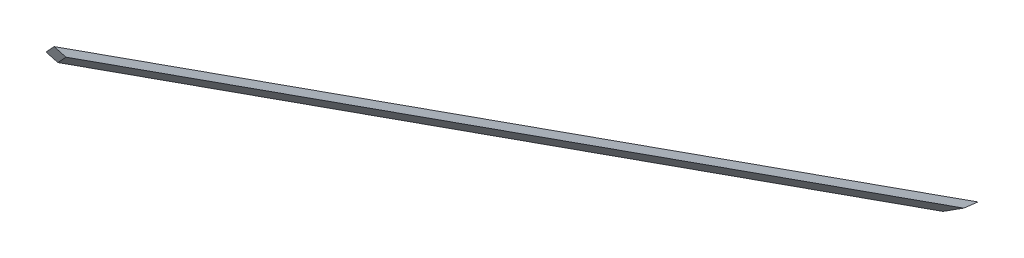
ISO-10303-21;
HEADER;
FILE_DESCRIPTION(('STEP AP214'),'2;1');
FILE_NAME('part.step','',(''),(''),'','','');
FILE_SCHEMA(('AUTOMOTIVE_DESIGN { 1 0 10303 214 1 1 1 1 }'));
ENDSEC;
DATA;
#1=APPLICATION_CONTEXT('core data for automotive mechanical design processes');
#2=APPLICATION_PROTOCOL_DEFINITION('international standard','automotive_design',2000,#1);
#3=PRODUCT_CONTEXT('',#1,'mechanical');
#4=PRODUCT('Part','Part','',(#3));
#5=PRODUCT_RELATED_PRODUCT_CATEGORY('part','',(#4));
#6=PRODUCT_DEFINITION_FORMATION('','',#4);
#7=PRODUCT_DEFINITION_CONTEXT('part definition',#1,'design');
#8=PRODUCT_DEFINITION('design','',#6,#7);
#9=PRODUCT_DEFINITION_SHAPE('','',#8);
#10=(LENGTH_UNIT() NAMED_UNIT(*) SI_UNIT(.MILLI.,.METRE.));
#11=(NAMED_UNIT(*) PLANE_ANGLE_UNIT() SI_UNIT($,.RADIAN.));
#12=(NAMED_UNIT(*) SI_UNIT($,.STERADIAN.) SOLID_ANGLE_UNIT());
#13=UNCERTAINTY_MEASURE_WITH_UNIT(LENGTH_MEASURE(1.E-05),#10,'distance_accuracy_value','');
#14=(GEOMETRIC_REPRESENTATION_CONTEXT(3) GLOBAL_UNCERTAINTY_ASSIGNED_CONTEXT((#13)) GLOBAL_UNIT_ASSIGNED_CONTEXT((#10,
#11,#12)) REPRESENTATION_CONTEXT('',''));
#15=CARTESIAN_POINT('',(0.,0.,0.));
#16=DIRECTION('',(0.,0.,1.));
#17=DIRECTION('',(1.,0.,0.));
#18=AXIS2_PLACEMENT_3D('',#15,#16,#17);
#19=CARTESIAN_POINT('',(0.,0.,0.));
#20=DIRECTION('',(-0.0650366103204272,0.480974248354035,-0.87431917040535));
#21=DIRECTION('',(0.,0.876174137459205,0.481994689646699));
#22=AXIS2_PLACEMENT_3D('',#19,#20,#21);
#23=PLANE('',#22);
#24=DIRECTION('',(0.654469130781617,0.681969712719901,0.326477361828797));
#25=VECTOR('',#24,1.);
#26=CARTESIAN_POINT('',(0.,0.,0.));
#27=LINE('',#26,#25);
#28=CARTESIAN_POINT('',(4844.17184578383,5047.72238545407,2416.48134354034));
#29=VERTEX_POINT('',#28);
#30=CARTESIAN_POINT('',(4911.52852168568,5117.90936716807,2450.08175158974));
#31=VERTEX_POINT('',#30);
#32=EDGE_CURVE('E106',#29,#31,#27,.T.);
#33=ORIENTED_EDGE('',*,*,#32,.F.);
#34=DIRECTION('',(0.577222347305059,-0.696579994970428,-0.426134570738677));
#35=VECTOR('',#34,1.);
#36=CARTESIAN_POINT('',(5854.15188859412,3828.89935057735,1670.86327451201));
#37=LINE('',#36,#35);
#38=CARTESIAN_POINT('',(4872.72774204691,5013.26172022138,2395.39994457346));
#39=VERTEX_POINT('',#38);
#40=EDGE_CURVE('E61',#29,#39,#37,.T.);
#41=ORIENTED_EDGE('',*,*,#40,.T.);
#42=DIRECTION('',(0.654469130781619,0.6819697127199,0.326477361828794));
#43=VECTOR('',#42,1.);
#44=CARTESIAN_POINT('',(36.2097667232203,-26.4851816026538,-17.263319063484));
#45=LINE('',#44,#43);
#46=CARTESIAN_POINT('',(4940.08441794875,5083.44870193537,2429.00035262285));
#47=VERTEX_POINT('',#46);
#48=EDGE_CURVE('E95',#39,#47,#45,.T.);
#49=ORIENTED_EDGE('',*,*,#48,.T.);
#50=DIRECTION('',(0.577222347305059,-0.696579994970428,-0.426134570738677));
#51=VECTOR('',#50,1.);
#52=CARTESIAN_POINT('',(5935.55201724218,3882.13898385792,1694.09609936638));
#53=LINE('',#52,#51);
#54=EDGE_CURVE('E68',#31,#47,#53,.T.);
#55=ORIENTED_EDGE('',*,*,#54,.F.);
#56=EDGE_LOOP('',(#33,#41,#49,#55));
#57=FACE_BOUND('',#56,.T.);
#58=ADVANCED_FACE('F45',(#57),#23,.F.);
#59=CARTESIAN_POINT('',(0.,0.,0.));
#60=DIRECTION('',(-0.537110456627946,0.841606576533205,-0.0566632836762697));
#61=DIRECTION('',(-0.842960923517797,-0.537974796270256,0.));
#62=AXIS2_PLACEMENT_3D('',#59,#60,#61);
#63=PLANE('',#62);
#64=DIRECTION('',(-0.842960923517797,-0.537974796270256,0.));
#65=VECTOR('',#64,1.);
#66=CARTESIAN_POINT('',(-1.46530917941562,2.29601532949622,47.9918265788923));
#67=LINE('',#66,#65);
#68=CARTESIAN_POINT('',(6314.76033140262,4033.2897510877,47.9918265807333));
#69=VERTEX_POINT('',#68);
#70=CARTESIAN_POINT('',(6228.00445086859,3977.92244300328,47.9918265807331));
#71=VERTEX_POINT('',#70);
#72=EDGE_CURVE('E49',#69,#71,#67,.T.);
#73=ORIENTED_EDGE('',*,*,#72,.T.);
#74=DIRECTION('',(0.228891628224949,0.0807637152780898,-0.970095791570611));
#75=VECTOR('',#74,1.);
#76=CARTESIAN_POINT('',(5838.83072616611,3840.60367717802,1697.40030626837));
#77=LINE('',#76,#75);
#78=CARTESIAN_POINT('',(6239.3279999686,3981.91792288404,-1.43504112286665E-12));
#79=VERTEX_POINT('',#78);
#80=EDGE_CURVE('E87',#71,#79,#77,.T.);
#81=ORIENTED_EDGE('',*,*,#80,.T.);
#82=DIRECTION('',(-0.842960923517798,-0.537974796270254,0.));
#83=VECTOR('',#82,1.);
#84=CARTESIAN_POINT('',(0.,0.,0.));
#85=LINE('',#84,#83);
#86=CARTESIAN_POINT('',(6326.08388050264,4037.28523096847,-1.55431223447522E-12));
#87=VERTEX_POINT('',#86);
#88=EDGE_CURVE('E104',#87,#79,#85,.T.);
#89=ORIENTED_EDGE('',*,*,#88,.F.);
#90=DIRECTION('',(0.228891628224949,0.0807637152780898,-0.970095791570611));
#91=VECTOR('',#90,1.);
#92=CARTESIAN_POINT('',(5920.01781890113,3894.0060554145,1721.00212014797));
#93=LINE('',#92,#91);
#94=EDGE_CURVE('E99',#69,#87,#93,.T.);
#95=ORIENTED_EDGE('',*,*,#94,.F.);
#96=EDGE_LOOP('',(#73,#81,#89,#95));
#97=FACE_BOUND('',#96,.T.);
#98=ADVANCED_FACE('F98',(#97),#63,.F.);
#99=CARTESIAN_POINT('',(11.0209605962291,-17.2689114558139,13.9795177746739));
#100=DIRECTION('',(0.444370527755255,-0.696290965780646,0.563661001875038));
#101=DIRECTION('',(0.,-0.629196129232445,-0.777246570245832));
#102=AXIS2_PLACEMENT_3D('',#99,#100,#101);
#103=PLANE('',#102);
#104=ORIENTED_EDGE('',*,*,#72,.F.);
#105=DIRECTION('',(-0.467086179481366,0.35682208977311,0.809016994374934));
#106=VECTOR('',#105,1.);
#107=CARTESIAN_POINT('',(5627.4223746759,4558.36922651161,1238.49608960088));
#108=LINE('',#107,#106);
#109=EDGE_CURVE('E110',#69,#47,#108,.T.);
#110=ORIENTED_EDGE('',*,*,#109,.T.);
#111=ORIENTED_EDGE('',*,*,#48,.F.);
#112=DIRECTION('',(-0.467086179481366,0.35682208977311,0.809016994374934));
#113=VECTOR('',#112,1.);
#114=CARTESIAN_POINT('',(5550.36609645797,4495.5920816124,1221.69588557619));
#115=LINE('',#114,#113);
#116=EDGE_CURVE('E91',#71,#39,#115,.T.);
#117=ORIENTED_EDGE('',*,*,#116,.F.);
#118=EDGE_LOOP('',(#104,#110,#111,#117));
#119=FACE_BOUND('',#118,.T.);
#120=ADVANCED_FACE('F103',(#119),#103,.T.);
#121=CARTESIAN_POINT('',(0.,0.,0.));
#122=DIRECTION('',(0.444370527755255,-0.696290965780645,0.563661001875038));
#123=DIRECTION('',(0.,-0.629196129232445,-0.777246570245832));
#124=AXIS2_PLACEMENT_3D('',#121,#122,#123);
#125=PLANE('',#124);
#126=DIRECTION('',(0.467086179481366,-0.35682208977311,-0.809016994374934));
#127=VECTOR('',#126,1.);
#128=CARTESIAN_POINT('',(5541.74992287622,4514.82015416905,1208.24067177017));
#129=LINE('',#128,#127);
#130=EDGE_CURVE('E12',#29,#79,#129,.T.);
#131=ORIENTED_EDGE('',*,*,#130,.F.);
#132=ORIENTED_EDGE('',*,*,#32,.T.);
#133=DIRECTION('',(-0.467086179481359,0.35682208977309,0.809016994374947));
#134=VECTOR('',#133,1.);
#135=CARTESIAN_POINT('',(5618.80620109417,4577.59729906827,1225.0408757949));
#136=LINE('',#135,#134);
#137=EDGE_CURVE('E54',#87,#31,#136,.T.);
#138=ORIENTED_EDGE('',*,*,#137,.F.);
#139=ORIENTED_EDGE('',*,*,#88,.T.);
#140=EDGE_LOOP('',(#131,#132,#138,#139));
#141=FACE_BOUND('',#140,.T.);
#142=ADVANCED_FACE('F119',(#141),#125,.F.);
#143=CARTESIAN_POINT('',(5856.14339427185,3813.2116707772,1699.20471012312));
#144=DIRECTION('',(-0.814278199040255,-0.530215010595009,-0.23626903543946));
#145=DIRECTION('',(0.545664026406652,-0.838004039540192,0.));
#146=AXIS2_PLACEMENT_3D('',#143,#144,#145);
#147=PLANE('',#146);
#148=ORIENTED_EDGE('',*,*,#40,.F.);
#149=ORIENTED_EDGE('',*,*,#130,.T.);
#150=ORIENTED_EDGE('',*,*,#80,.F.);
#151=ORIENTED_EDGE('',*,*,#116,.T.);
#152=EDGE_LOOP('',(#148,#149,#150,#151));
#153=FACE_BOUND('',#152,.T.);
#154=ADVANCED_FACE('F89',(#153),#147,.T.);
#155=CARTESIAN_POINT('',(5937.57121417587,3866.2331718367,1722.83161366707));
#156=DIRECTION('',(-0.814278199040255,-0.530215010595009,-0.23626903543946));
#157=DIRECTION('',(-0.529104719738801,0.845360491702084,-0.0735787647309699));
#158=AXIS2_PLACEMENT_3D('',#155,#156,#157);
#159=PLANE('',#158);
#160=ORIENTED_EDGE('',*,*,#137,.T.);
#161=ORIENTED_EDGE('',*,*,#54,.T.);
#162=ORIENTED_EDGE('',*,*,#109,.F.);
#163=ORIENTED_EDGE('',*,*,#94,.T.);
#164=EDGE_LOOP('',(#160,#161,#162,#163));
#165=FACE_BOUND('',#164,.T.);
#166=ADVANCED_FACE('F47',(#165),#159,.F.);
#167=CLOSED_SHELL('',(#58,#98,#120,#142,#154,#166));
#168=MANIFOLD_SOLID_BREP('B2',#167);
#169=ADVANCED_BREP_SHAPE_REPRESENTATION('',(#18,#168),#14);
#170=SHAPE_DEFINITION_REPRESENTATION(#9,#169);
ENDSEC;
END-ISO-10303-21;
